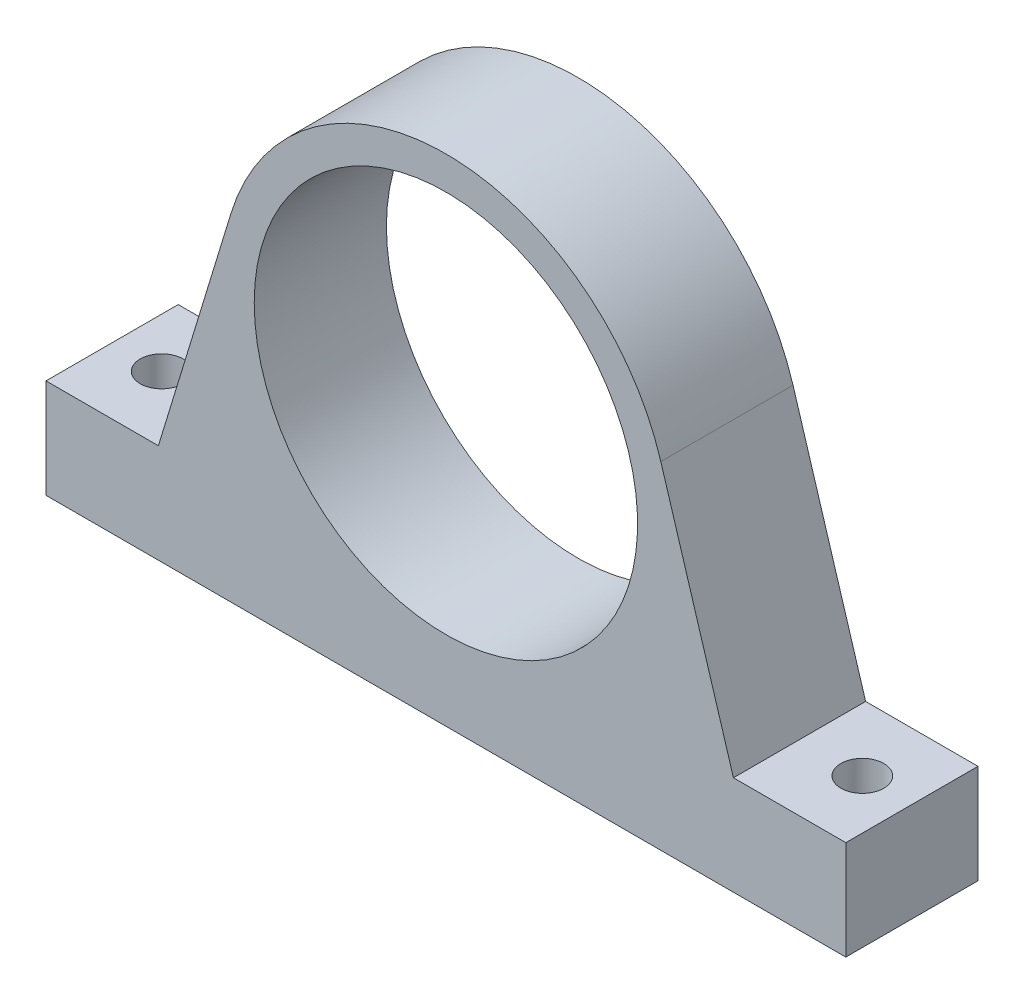
ISO-10303-21;
HEADER;
FILE_DESCRIPTION(('STEP AP214'),'2;1');
FILE_NAME('part.step','',(''),(''),'','','');
FILE_SCHEMA(('AUTOMOTIVE_DESIGN { 1 0 10303 214 1 1 1 1 }'));
ENDSEC;
DATA;
#1=APPLICATION_CONTEXT('core data for automotive mechanical design processes');
#2=APPLICATION_PROTOCOL_DEFINITION('international standard','automotive_design',2000,#1);
#3=PRODUCT_CONTEXT('',#1,'mechanical');
#4=PRODUCT('Part','Part','',(#3));
#5=PRODUCT_RELATED_PRODUCT_CATEGORY('part','',(#4));
#6=PRODUCT_DEFINITION_FORMATION('','',#4);
#7=PRODUCT_DEFINITION_CONTEXT('part definition',#1,'design');
#8=PRODUCT_DEFINITION('design','',#6,#7);
#9=PRODUCT_DEFINITION_SHAPE('','',#8);
#10=(LENGTH_UNIT() NAMED_UNIT(*) SI_UNIT(.MILLI.,.METRE.));
#11=(NAMED_UNIT(*) PLANE_ANGLE_UNIT() SI_UNIT($,.RADIAN.));
#12=(NAMED_UNIT(*) SI_UNIT($,.STERADIAN.) SOLID_ANGLE_UNIT());
#13=UNCERTAINTY_MEASURE_WITH_UNIT(LENGTH_MEASURE(1.E-05),#10,'distance_accuracy_value','');
#14=(GEOMETRIC_REPRESENTATION_CONTEXT(3) GLOBAL_UNCERTAINTY_ASSIGNED_CONTEXT((#13)) GLOBAL_UNIT_ASSIGNED_CONTEXT((#10,
#11,#12)) REPRESENTATION_CONTEXT('',''));
#15=CARTESIAN_POINT('',(0.,0.,0.));
#16=DIRECTION('',(0.,0.,1.));
#17=DIRECTION('',(1.,0.,0.));
#18=AXIS2_PLACEMENT_3D('',#15,#16,#17);
#19=CARTESIAN_POINT('',(-43.5,15.,20.));
#20=DIRECTION('',(-0.956323483326742,0.292310443258203,0.));
#21=DIRECTION('',(-0.292310443258203,-0.956323483326742,0.));
#22=AXIS2_PLACEMENT_3D('',#19,#20,#21);
#23=PLANE('',#22);
#24=DIRECTION('',(0.292310443258203,0.956323483326742,0.));
#25=VECTOR('',#24,1.);
#26=CARTESIAN_POINT('',(-43.5,15.,0.));
#27=LINE('',#26,#25);
#28=CARTESIAN_POINT('',(-43.5,15.,0.));
#29=VERTEX_POINT('',#28);
#30=CARTESIAN_POINT('',(-32.5149984331092,50.9385550707789,0.));
#31=VERTEX_POINT('',#30);
#32=EDGE_CURVE('E131',#29,#31,#27,.T.);
#33=ORIENTED_EDGE('',*,*,#32,.F.);
#34=DIRECTION('',(0.,0.,-1.));
#35=VECTOR('',#34,1.);
#36=CARTESIAN_POINT('',(-43.5,15.,20.));
#37=LINE('',#36,#35);
#38=CARTESIAN_POINT('',(-43.5,15.,20.));
#39=VERTEX_POINT('',#38);
#40=EDGE_CURVE('E11',#39,#29,#37,.T.);
#41=ORIENTED_EDGE('',*,*,#40,.F.);
#42=DIRECTION('',(0.292310443258203,0.956323483326742,0.));
#43=VECTOR('',#42,1.);
#44=CARTESIAN_POINT('',(-43.5,15.,20.));
#45=LINE('',#44,#43);
#46=CARTESIAN_POINT('',(-32.5149984331092,50.9385550707789,20.));
#47=VERTEX_POINT('',#46);
#48=EDGE_CURVE('E150',#39,#47,#45,.T.);
#49=ORIENTED_EDGE('',*,*,#48,.T.);
#50=DIRECTION('',(0.,0.,-1.));
#51=VECTOR('',#50,1.);
#52=CARTESIAN_POINT('',(-32.5149984331092,50.9385550707789,20.));
#53=LINE('',#52,#51);
#54=EDGE_CURVE('E92',#47,#31,#53,.T.);
#55=ORIENTED_EDGE('',*,*,#54,.T.);
#56=EDGE_LOOP('',(#33,#41,#49,#55));
#57=FACE_BOUND('',#56,.T.);
#58=ADVANCED_FACE('F36',(#57),#23,.T.);
#59=CARTESIAN_POINT('',(-60.5,15.,20.));
#60=DIRECTION('',(0.,1.,0.));
#61=DIRECTION('',(0.,0.,1.));
#62=AXIS2_PLACEMENT_3D('',#59,#60,#61);
#63=PLANE('',#62);
#64=CARTESIAN_POINT('',(-53.,15.,10.));
#65=DIRECTION('',(0.,1.,0.));
#66=DIRECTION('',(0.,0.,1.));
#67=AXIS2_PLACEMENT_3D('',#64,#65,#66);
#68=CIRCLE('',#67,3.25);
#69=CARTESIAN_POINT('',(-53.,15.,13.25));
#70=VERTEX_POINT('',#69);
#71=EDGE_CURVE('E167',#70,#70,#68,.T.);
#72=ORIENTED_EDGE('',*,*,#71,.F.);
#73=EDGE_LOOP('',(#72));
#74=FACE_BOUND('',#73,.T.);
#75=DIRECTION('',(1.,0.,0.));
#76=VECTOR('',#75,1.);
#77=CARTESIAN_POINT('',(-60.5,15.,0.));
#78=LINE('',#77,#76);
#79=CARTESIAN_POINT('',(-60.5,15.,0.));
#80=VERTEX_POINT('',#79);
#81=EDGE_CURVE('E148',#80,#29,#78,.T.);
#82=ORIENTED_EDGE('',*,*,#81,.F.);
#83=DIRECTION('',(0.,0.,-1.));
#84=VECTOR('',#83,1.);
#85=CARTESIAN_POINT('',(-60.5,15.,20.));
#86=LINE('',#85,#84);
#87=CARTESIAN_POINT('',(-60.5,15.,20.));
#88=VERTEX_POINT('',#87);
#89=EDGE_CURVE('E45',#88,#80,#86,.T.);
#90=ORIENTED_EDGE('',*,*,#89,.F.);
#91=DIRECTION('',(1.,0.,0.));
#92=VECTOR('',#91,1.);
#93=CARTESIAN_POINT('',(-60.5,15.,20.));
#94=LINE('',#93,#92);
#95=EDGE_CURVE('E126',#88,#39,#94,.T.);
#96=ORIENTED_EDGE('',*,*,#95,.T.);
#97=ORIENTED_EDGE('',*,*,#40,.T.);
#98=EDGE_LOOP('',(#82,#90,#96,#97));
#99=FACE_BOUND('',#98,.T.);
#100=ADVANCED_FACE('F199',(#74,#99),#63,.T.);
#101=CARTESIAN_POINT('',(-60.5,0.,20.));
#102=DIRECTION('',(-1.,0.,0.));
#103=DIRECTION('',(0.,0.,1.));
#104=AXIS2_PLACEMENT_3D('',#101,#102,#103);
#105=PLANE('',#104);
#106=DIRECTION('',(0.,1.,0.));
#107=VECTOR('',#106,1.);
#108=CARTESIAN_POINT('',(-60.5,0.,0.));
#109=LINE('',#108,#107);
#110=CARTESIAN_POINT('',(-60.5,0.,0.));
#111=VERTEX_POINT('',#110);
#112=EDGE_CURVE('E112',#111,#80,#109,.T.);
#113=ORIENTED_EDGE('',*,*,#112,.F.);
#114=DIRECTION('',(0.,0.,-1.));
#115=VECTOR('',#114,1.);
#116=CARTESIAN_POINT('',(-60.5,0.,20.));
#117=LINE('',#116,#115);
#118=CARTESIAN_POINT('',(-60.5,0.,20.));
#119=VERTEX_POINT('',#118);
#120=EDGE_CURVE('E106',#119,#111,#117,.T.);
#121=ORIENTED_EDGE('',*,*,#120,.F.);
#122=DIRECTION('',(0.,1.,0.));
#123=VECTOR('',#122,1.);
#124=CARTESIAN_POINT('',(-60.5,0.,20.));
#125=LINE('',#124,#123);
#126=EDGE_CURVE('E110',#119,#88,#125,.T.);
#127=ORIENTED_EDGE('',*,*,#126,.T.);
#128=ORIENTED_EDGE('',*,*,#89,.T.);
#129=EDGE_LOOP('',(#113,#121,#127,#128));
#130=FACE_BOUND('',#129,.T.);
#131=ADVANCED_FACE('F108',(#130),#105,.T.);
#132=CARTESIAN_POINT('',(-60.5,0.,20.));
#133=DIRECTION('',(0.,1.,0.));
#134=DIRECTION('',(-1.,0.,0.));
#135=AXIS2_PLACEMENT_3D('',#132,#133,#134);
#136=PLANE('',#135);
#137=CARTESIAN_POINT('',(53.,0.,10.));
#138=DIRECTION('',(0.,-1.,0.));
#139=DIRECTION('',(0.,0.,1.));
#140=AXIS2_PLACEMENT_3D('',#137,#138,#139);
#141=CIRCLE('',#140,3.25);
#142=CARTESIAN_POINT('',(53.,0.,13.25));
#143=VERTEX_POINT('',#142);
#144=EDGE_CURVE('E245',#143,#143,#141,.T.);
#145=ORIENTED_EDGE('',*,*,#144,.F.);
#146=EDGE_LOOP('',(#145));
#147=FACE_BOUND('',#146,.T.);
#148=CARTESIAN_POINT('',(-53.,0.,10.));
#149=DIRECTION('',(0.,1.,0.));
#150=DIRECTION('',(0.,0.,1.));
#151=AXIS2_PLACEMENT_3D('',#148,#149,#150);
#152=CIRCLE('',#151,3.25);
#153=CARTESIAN_POINT('',(-53.,0.,13.25));
#154=VERTEX_POINT('',#153);
#155=EDGE_CURVE('E172',#154,#154,#152,.T.);
#156=ORIENTED_EDGE('',*,*,#155,.T.);
#157=EDGE_LOOP('',(#156));
#158=FACE_BOUND('',#157,.T.);
#159=DIRECTION('',(1.,0.,0.));
#160=VECTOR('',#159,1.);
#161=CARTESIAN_POINT('',(-60.5,0.,0.));
#162=LINE('',#161,#160);
#163=CARTESIAN_POINT('',(60.5,0.,0.));
#164=VERTEX_POINT('',#163);
#165=EDGE_CURVE('E145',#111,#164,#162,.T.);
#166=ORIENTED_EDGE('',*,*,#165,.T.);
#167=DIRECTION('',(0.,0.,-1.));
#168=VECTOR('',#167,1.);
#169=CARTESIAN_POINT('',(60.5,0.,20.));
#170=LINE('',#169,#168);
#171=CARTESIAN_POINT('',(60.5,0.,20.));
#172=VERTEX_POINT('',#171);
#173=EDGE_CURVE('E115',#172,#164,#170,.T.);
#174=ORIENTED_EDGE('',*,*,#173,.F.);
#175=DIRECTION('',(1.,0.,0.));
#176=VECTOR('',#175,1.);
#177=CARTESIAN_POINT('',(-60.5,0.,20.));
#178=LINE('',#177,#176);
#179=EDGE_CURVE('E118',#119,#172,#178,.T.);
#180=ORIENTED_EDGE('',*,*,#179,.F.);
#181=ORIENTED_EDGE('',*,*,#120,.T.);
#182=EDGE_LOOP('',(#166,#174,#180,#181));
#183=FACE_BOUND('',#182,.T.);
#184=ADVANCED_FACE('F119',(#147,#158,#183),#136,.F.);
#185=CARTESIAN_POINT('',(60.5,0.,20.));
#186=DIRECTION('',(-1.,0.,0.));
#187=DIRECTION('',(0.,0.,1.));
#188=AXIS2_PLACEMENT_3D('',#185,#186,#187);
#189=PLANE('',#188);
#190=DIRECTION('',(0.,1.,0.));
#191=VECTOR('',#190,1.);
#192=CARTESIAN_POINT('',(60.5,0.,0.));
#193=LINE('',#192,#191);
#194=CARTESIAN_POINT('',(60.5,15.,0.));
#195=VERTEX_POINT('',#194);
#196=EDGE_CURVE('E143',#164,#195,#193,.T.);
#197=ORIENTED_EDGE('',*,*,#196,.T.);
#198=DIRECTION('',(0.,0.,-1.));
#199=VECTOR('',#198,1.);
#200=CARTESIAN_POINT('',(60.5,15.,20.));
#201=LINE('',#200,#199);
#202=CARTESIAN_POINT('',(60.5,15.,20.));
#203=VERTEX_POINT('',#202);
#204=EDGE_CURVE('E154',#203,#195,#201,.T.);
#205=ORIENTED_EDGE('',*,*,#204,.F.);
#206=DIRECTION('',(0.,1.,0.));
#207=VECTOR('',#206,1.);
#208=CARTESIAN_POINT('',(60.5,0.,20.));
#209=LINE('',#208,#207);
#210=EDGE_CURVE('E123',#172,#203,#209,.T.);
#211=ORIENTED_EDGE('',*,*,#210,.F.);
#212=ORIENTED_EDGE('',*,*,#173,.T.);
#213=EDGE_LOOP('',(#197,#205,#211,#212));
#214=FACE_BOUND('',#213,.T.);
#215=ADVANCED_FACE('F186',(#214),#189,.F.);
#216=CARTESIAN_POINT('',(60.5,15.,20.));
#217=DIRECTION('',(0.,-1.,0.));
#218=DIRECTION('',(1.,0.,0.));
#219=AXIS2_PLACEMENT_3D('',#216,#217,#218);
#220=PLANE('',#219);
#221=CARTESIAN_POINT('',(53.,15.,10.));
#222=DIRECTION('',(0.,-1.,0.));
#223=DIRECTION('',(1.,0.,0.));
#224=AXIS2_PLACEMENT_3D('',#221,#222,#223);
#225=CIRCLE('',#224,3.25);
#226=CARTESIAN_POINT('',(56.25,15.,10.));
#227=VERTEX_POINT('',#226);
#228=EDGE_CURVE('E39',#227,#227,#225,.F.);
#229=ORIENTED_EDGE('',*,*,#228,.F.);
#230=EDGE_LOOP('',(#229));
#231=FACE_BOUND('',#230,.T.);
#232=DIRECTION('',(-1.,0.,0.));
#233=VECTOR('',#232,1.);
#234=CARTESIAN_POINT('',(60.5,15.,0.));
#235=LINE('',#234,#233);
#236=CARTESIAN_POINT('',(43.5,15.,0.));
#237=VERTEX_POINT('',#236);
#238=EDGE_CURVE('E141',#195,#237,#235,.T.);
#239=ORIENTED_EDGE('',*,*,#238,.T.);
#240=DIRECTION('',(0.,0.,-1.));
#241=VECTOR('',#240,1.);
#242=CARTESIAN_POINT('',(43.5,15.,20.));
#243=LINE('',#242,#241);
#244=CARTESIAN_POINT('',(43.5,15.,20.));
#245=VERTEX_POINT('',#244);
#246=EDGE_CURVE('E157',#245,#237,#243,.T.);
#247=ORIENTED_EDGE('',*,*,#246,.F.);
#248=DIRECTION('',(-1.,0.,0.));
#249=VECTOR('',#248,1.);
#250=CARTESIAN_POINT('',(60.5,15.,20.));
#251=LINE('',#250,#249);
#252=EDGE_CURVE('E181',#203,#245,#251,.T.);
#253=ORIENTED_EDGE('',*,*,#252,.F.);
#254=ORIENTED_EDGE('',*,*,#204,.T.);
#255=EDGE_LOOP('',(#239,#247,#253,#254));
#256=FACE_BOUND('',#255,.T.);
#257=ADVANCED_FACE('F190',(#231,#256),#220,.F.);
#258=CARTESIAN_POINT('',(43.5,15.,20.));
#259=DIRECTION('',(-0.956323483326742,-0.292310443258202,0.));
#260=DIRECTION('',(0.292310443258202,-0.956323483326742,0.));
#261=AXIS2_PLACEMENT_3D('',#258,#259,#260);
#262=PLANE('',#261);
#263=DIRECTION('',(-0.292310443258202,0.956323483326742,0.));
#264=VECTOR('',#263,1.);
#265=CARTESIAN_POINT('',(43.5,15.,0.));
#266=LINE('',#265,#264);
#267=CARTESIAN_POINT('',(32.5149984331092,50.9385550707789,0.));
#268=VERTEX_POINT('',#267);
#269=EDGE_CURVE('E138',#237,#268,#266,.T.);
#270=ORIENTED_EDGE('',*,*,#269,.T.);
#271=DIRECTION('',(0.,0.,-1.));
#272=VECTOR('',#271,1.);
#273=CARTESIAN_POINT('',(32.5149984331092,50.9385550707789,20.));
#274=LINE('',#273,#272);
#275=CARTESIAN_POINT('',(32.5149984331092,50.9385550707789,20.));
#276=VERTEX_POINT('',#275);
#277=EDGE_CURVE('E160',#276,#268,#274,.T.);
#278=ORIENTED_EDGE('',*,*,#277,.F.);
#279=DIRECTION('',(-0.292310443258202,0.956323483326742,0.));
#280=VECTOR('',#279,1.);
#281=CARTESIAN_POINT('',(43.5,15.,20.));
#282=LINE('',#281,#280);
#283=EDGE_CURVE('E179',#245,#276,#282,.T.);
#284=ORIENTED_EDGE('',*,*,#283,.F.);
#285=ORIENTED_EDGE('',*,*,#246,.T.);
#286=EDGE_LOOP('',(#270,#278,#284,#285));
#287=FACE_BOUND('',#286,.T.);
#288=ADVANCED_FACE('F195',(#287),#262,.F.);
#289=CARTESIAN_POINT('',(0.,41.,20.));
#290=DIRECTION('',(0.,0.,-1.));
#291=DIRECTION('',(-1.,0.,0.));
#292=AXIS2_PLACEMENT_3D('',#289,#290,#291);
#293=CYLINDRICAL_SURFACE('',#292,34.);
#294=CARTESIAN_POINT('',(0.,41.,0.));
#295=DIRECTION('',(0.,0.,-1.));
#296=DIRECTION('',(-1.,0.,0.));
#297=AXIS2_PLACEMENT_3D('',#294,#295,#296);
#298=CIRCLE('',#297,34.);
#299=EDGE_CURVE('E134',#31,#268,#298,.T.);
#300=ORIENTED_EDGE('',*,*,#299,.F.);
#301=ORIENTED_EDGE('',*,*,#54,.F.);
#302=CARTESIAN_POINT('',(0.,41.,20.));
#303=DIRECTION('',(0.,0.,-1.));
#304=DIRECTION('',(-1.,0.,0.));
#305=AXIS2_PLACEMENT_3D('',#302,#303,#304);
#306=CIRCLE('',#305,34.);
#307=EDGE_CURVE('E177',#47,#276,#306,.T.);
#308=ORIENTED_EDGE('',*,*,#307,.T.);
#309=ORIENTED_EDGE('',*,*,#277,.T.);
#310=EDGE_LOOP('',(#300,#301,#308,#309));
#311=FACE_BOUND('',#310,.T.);
#312=ADVANCED_FACE('F196',(#311),#293,.T.);
#313=CARTESIAN_POINT('',(0.,41.,20.));
#314=DIRECTION('',(0.,0.,-1.));
#315=DIRECTION('',(-1.,0.,0.));
#316=AXIS2_PLACEMENT_3D('',#313,#314,#315);
#317=PLANE('',#316);
#318=CARTESIAN_POINT('',(0.,41.,20.));
#319=DIRECTION('',(0.,0.,-1.));
#320=DIRECTION('',(-1.,0.,0.));
#321=AXIS2_PLACEMENT_3D('',#318,#319,#320);
#322=CIRCLE('',#321,29.);
#323=CARTESIAN_POINT('',(-29.,41.,20.));
#324=VERTEX_POINT('',#323);
#325=EDGE_CURVE('E163',#324,#324,#322,.T.);
#326=ORIENTED_EDGE('',*,*,#325,.T.);
#327=EDGE_LOOP('',(#326));
#328=FACE_BOUND('',#327,.T.);
#329=ORIENTED_EDGE('',*,*,#48,.F.);
#330=ORIENTED_EDGE('',*,*,#95,.F.);
#331=ORIENTED_EDGE('',*,*,#126,.F.);
#332=ORIENTED_EDGE('',*,*,#179,.T.);
#333=ORIENTED_EDGE('',*,*,#210,.T.);
#334=ORIENTED_EDGE('',*,*,#252,.T.);
#335=ORIENTED_EDGE('',*,*,#283,.T.);
#336=ORIENTED_EDGE('',*,*,#307,.F.);
#337=EDGE_LOOP('',(#329,#330,#331,#332,#333,#334,#335,#336));
#338=FACE_BOUND('',#337,.T.);
#339=ADVANCED_FACE('F125',(#328,#338),#317,.F.);
#340=CARTESIAN_POINT('',(0.,41.,0.));
#341=DIRECTION('',(0.,0.,-1.));
#342=DIRECTION('',(-1.,0.,0.));
#343=AXIS2_PLACEMENT_3D('',#340,#341,#342);
#344=PLANE('',#343);
#345=CARTESIAN_POINT('',(0.,41.,0.));
#346=DIRECTION('',(0.,0.,-1.));
#347=DIRECTION('',(-1.,0.,0.));
#348=AXIS2_PLACEMENT_3D('',#345,#346,#347);
#349=CIRCLE('',#348,29.);
#350=CARTESIAN_POINT('',(-29.,41.,0.));
#351=VERTEX_POINT('',#350);
#352=EDGE_CURVE('E135',#351,#351,#349,.T.);
#353=ORIENTED_EDGE('',*,*,#352,.F.);
#354=EDGE_LOOP('',(#353));
#355=FACE_BOUND('',#354,.T.);
#356=ORIENTED_EDGE('',*,*,#32,.T.);
#357=ORIENTED_EDGE('',*,*,#299,.T.);
#358=ORIENTED_EDGE('',*,*,#269,.F.);
#359=ORIENTED_EDGE('',*,*,#238,.F.);
#360=ORIENTED_EDGE('',*,*,#196,.F.);
#361=ORIENTED_EDGE('',*,*,#165,.F.);
#362=ORIENTED_EDGE('',*,*,#112,.T.);
#363=ORIENTED_EDGE('',*,*,#81,.T.);
#364=EDGE_LOOP('',(#356,#357,#358,#359,#360,#361,#362,#363));
#365=FACE_BOUND('',#364,.T.);
#366=ADVANCED_FACE('F198',(#355,#365),#344,.T.);
#367=CARTESIAN_POINT('',(0.,41.,20.));
#368=DIRECTION('',(0.,0.,-1.));
#369=DIRECTION('',(-1.,0.,0.));
#370=AXIS2_PLACEMENT_3D('',#367,#368,#369);
#371=CYLINDRICAL_SURFACE('',#370,29.);
#372=ORIENTED_EDGE('',*,*,#352,.T.);
#373=EDGE_LOOP('',(#372));
#374=FACE_BOUND('',#373,.T.);
#375=ORIENTED_EDGE('',*,*,#325,.F.);
#376=EDGE_LOOP('',(#375));
#377=FACE_BOUND('',#376,.T.);
#378=ADVANCED_FACE('F228',(#374,#377),#371,.F.);
#379=CARTESIAN_POINT('',(-53.,0.,10.));
#380=DIRECTION('',(0.,1.,0.));
#381=DIRECTION('',(0.,0.,1.));
#382=AXIS2_PLACEMENT_3D('',#379,#380,#381);
#383=CYLINDRICAL_SURFACE('',#382,3.25);
#384=ORIENTED_EDGE('',*,*,#71,.T.);
#385=EDGE_LOOP('',(#384));
#386=FACE_BOUND('',#385,.T.);
#387=ORIENTED_EDGE('',*,*,#155,.F.);
#388=EDGE_LOOP('',(#387));
#389=FACE_BOUND('',#388,.T.);
#390=ADVANCED_FACE('F233',(#386,#389),#383,.F.);
#391=CARTESIAN_POINT('',(53.,0.,10.));
#392=DIRECTION('',(0.,1.,0.));
#393=DIRECTION('',(0.,0.,1.));
#394=AXIS2_PLACEMENT_3D('',#391,#392,#393);
#395=CYLINDRICAL_SURFACE('',#394,3.25);
#396=ORIENTED_EDGE('',*,*,#144,.T.);
#397=EDGE_LOOP('',(#396));
#398=FACE_BOUND('',#397,.T.);
#399=ORIENTED_EDGE('',*,*,#228,.T.);
#400=EDGE_LOOP('',(#399));
#401=FACE_BOUND('',#400,.T.);
#402=ADVANCED_FACE('F236',(#398,#401),#395,.F.);
#403=CLOSED_SHELL('',(#58,#100,#131,#184,#215,#257,#288,#312,#339,#366,#378,#390,#402));
#404=MANIFOLD_SOLID_BREP('B2',#403);
#405=ADVANCED_BREP_SHAPE_REPRESENTATION('',(#18,#404),#14);
#406=SHAPE_DEFINITION_REPRESENTATION(#9,#405);
ENDSEC;
END-ISO-10303-21;
